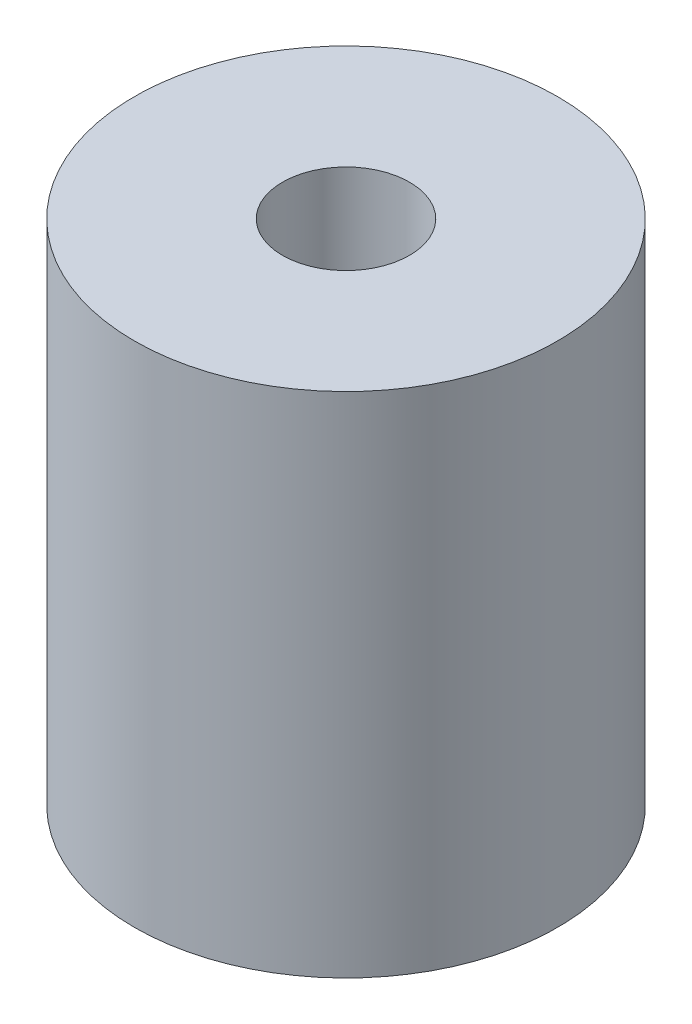
ISO-10303-21;
HEADER;
FILE_DESCRIPTION(('STEP AP214'),'2;1');
FILE_NAME('part.step','',(''),(''),'','','');
FILE_SCHEMA(('AUTOMOTIVE_DESIGN { 1 0 10303 214 1 1 1 1 }'));
ENDSEC;
DATA;
#1=APPLICATION_CONTEXT('core data for automotive mechanical design processes');
#2=APPLICATION_PROTOCOL_DEFINITION('international standard','automotive_design',2000,#1);
#3=PRODUCT_CONTEXT('',#1,'mechanical');
#4=PRODUCT('Part','Part','',(#3));
#5=PRODUCT_RELATED_PRODUCT_CATEGORY('part','',(#4));
#6=PRODUCT_DEFINITION_FORMATION('','',#4);
#7=PRODUCT_DEFINITION_CONTEXT('part definition',#1,'design');
#8=PRODUCT_DEFINITION('design','',#6,#7);
#9=PRODUCT_DEFINITION_SHAPE('','',#8);
#10=(LENGTH_UNIT() NAMED_UNIT(*) SI_UNIT(.MILLI.,.METRE.));
#11=(NAMED_UNIT(*) PLANE_ANGLE_UNIT() SI_UNIT($,.RADIAN.));
#12=(NAMED_UNIT(*) SI_UNIT($,.STERADIAN.) SOLID_ANGLE_UNIT());
#13=UNCERTAINTY_MEASURE_WITH_UNIT(LENGTH_MEASURE(1.E-05),#10,'distance_accuracy_value','');
#14=(GEOMETRIC_REPRESENTATION_CONTEXT(3) GLOBAL_UNCERTAINTY_ASSIGNED_CONTEXT((#13)) GLOBAL_UNIT_ASSIGNED_CONTEXT((#10,
#11,#12)) REPRESENTATION_CONTEXT('',''));
#15=CARTESIAN_POINT('',(0.,0.,0.));
#16=DIRECTION('',(0.,0.,1.));
#17=DIRECTION('',(1.,0.,0.));
#18=AXIS2_PLACEMENT_3D('',#15,#16,#17);
#19=CARTESIAN_POINT('',(0.,12.,0.));
#20=DIRECTION('',(0.,-1.,0.));
#21=DIRECTION('',(0.,0.,-1.));
#22=AXIS2_PLACEMENT_3D('',#19,#20,#21);
#23=CYLINDRICAL_SURFACE('',#22,5.);
#24=CARTESIAN_POINT('',(0.,12.,0.));
#25=DIRECTION('',(0.,1.,0.));
#26=DIRECTION('',(0.,0.,1.));
#27=AXIS2_PLACEMENT_3D('',#24,#25,#26);
#28=CIRCLE('',#27,5.);
#29=CARTESIAN_POINT('',(0.,12.,5.));
#30=VERTEX_POINT('',#29);
#31=EDGE_CURVE('E10',#30,#30,#28,.T.);
#32=ORIENTED_EDGE('',*,*,#31,.F.);
#33=EDGE_LOOP('',(#32));
#34=FACE_BOUND('',#33,.T.);
#35=CARTESIAN_POINT('',(0.,0.,0.));
#36=DIRECTION('',(0.,1.,0.));
#37=DIRECTION('',(0.,0.,1.));
#38=AXIS2_PLACEMENT_3D('',#35,#36,#37);
#39=CIRCLE('',#38,5.);
#40=CARTESIAN_POINT('',(0.,0.,5.));
#41=VERTEX_POINT('',#40);
#42=EDGE_CURVE('E34',#41,#41,#39,.T.);
#43=ORIENTED_EDGE('',*,*,#42,.T.);
#44=EDGE_LOOP('',(#43));
#45=FACE_BOUND('',#44,.T.);
#46=ADVANCED_FACE('F31',(#34,#45),#23,.T.);
#47=CARTESIAN_POINT('',(0.,12.,0.));
#48=DIRECTION('',(0.,1.,0.));
#49=DIRECTION('',(0.,0.,1.));
#50=AXIS2_PLACEMENT_3D('',#47,#48,#49);
#51=PLANE('',#50);
#52=CARTESIAN_POINT('',(0.,12.,0.));
#53=DIRECTION('',(0.,1.,0.));
#54=DIRECTION('',(0.,0.,1.));
#55=AXIS2_PLACEMENT_3D('',#52,#53,#54);
#56=CIRCLE('',#55,1.5);
#57=CARTESIAN_POINT('',(0.,12.,1.5));
#58=VERTEX_POINT('',#57);
#59=EDGE_CURVE('E43',#58,#58,#56,.T.);
#60=ORIENTED_EDGE('',*,*,#59,.F.);
#61=EDGE_LOOP('',(#60));
#62=FACE_BOUND('',#61,.T.);
#63=ORIENTED_EDGE('',*,*,#31,.T.);
#64=EDGE_LOOP('',(#63));
#65=FACE_BOUND('',#64,.T.);
#66=ADVANCED_FACE('F68',(#62,#65),#51,.T.);
#67=CARTESIAN_POINT('',(0.,0.,0.));
#68=DIRECTION('',(0.,1.,0.));
#69=DIRECTION('',(0.,0.,1.));
#70=AXIS2_PLACEMENT_3D('',#67,#68,#69);
#71=PLANE('',#70);
#72=CARTESIAN_POINT('',(0.,0.,0.));
#73=DIRECTION('',(0.,-1.,0.));
#74=DIRECTION('',(0.,0.,-1.));
#75=AXIS2_PLACEMENT_3D('',#72,#73,#74);
#76=CIRCLE('',#75,1.5);
#77=CARTESIAN_POINT('',(0.,0.,-1.5));
#78=VERTEX_POINT('',#77);
#79=EDGE_CURVE('E49',#78,#78,#76,.T.);
#80=ORIENTED_EDGE('',*,*,#79,.F.);
#81=EDGE_LOOP('',(#80));
#82=FACE_BOUND('',#81,.T.);
#83=ORIENTED_EDGE('',*,*,#42,.F.);
#84=EDGE_LOOP('',(#83));
#85=FACE_BOUND('',#84,.T.);
#86=ADVANCED_FACE('F64',(#82,#85),#71,.F.);
#87=CARTESIAN_POINT('',(0.,7.,0.));
#88=DIRECTION('',(0.,1.,0.));
#89=DIRECTION('',(0.,0.,1.));
#90=AXIS2_PLACEMENT_3D('',#87,#88,#89);
#91=CYLINDRICAL_SURFACE('',#90,1.5);
#92=CARTESIAN_POINT('',(0.,7.,0.));
#93=DIRECTION('',(0.,1.,0.));
#94=DIRECTION('',(0.,0.,1.));
#95=AXIS2_PLACEMENT_3D('',#92,#93,#94);
#96=CIRCLE('',#95,1.5);
#97=CARTESIAN_POINT('',(0.,7.,1.5));
#98=VERTEX_POINT('',#97);
#99=EDGE_CURVE('E41',#98,#98,#96,.T.);
#100=ORIENTED_EDGE('',*,*,#99,.F.);
#101=EDGE_LOOP('',(#100));
#102=FACE_BOUND('',#101,.T.);
#103=ORIENTED_EDGE('',*,*,#59,.T.);
#104=EDGE_LOOP('',(#103));
#105=FACE_BOUND('',#104,.T.);
#106=ADVANCED_FACE('F67',(#102,#105),#91,.F.);
#107=CARTESIAN_POINT('',(0.,7.,0.));
#108=DIRECTION('',(0.,1.,0.));
#109=DIRECTION('',(0.,0.,1.));
#110=AXIS2_PLACEMENT_3D('',#107,#108,#109);
#111=PLANE('',#110);
#112=ORIENTED_EDGE('',*,*,#99,.T.);
#113=EDGE_LOOP('',(#112));
#114=FACE_BOUND('',#113,.T.);
#115=ADVANCED_FACE('F60',(#114),#111,.T.);
#116=CARTESIAN_POINT('',(0.,5.,0.));
#117=DIRECTION('',(0.,-1.,0.));
#118=DIRECTION('',(0.,0.,-1.));
#119=AXIS2_PLACEMENT_3D('',#116,#117,#118);
#120=CYLINDRICAL_SURFACE('',#119,1.5);
#121=CARTESIAN_POINT('',(0.,5.,0.));
#122=DIRECTION('',(0.,-1.,0.));
#123=DIRECTION('',(0.,0.,-1.));
#124=AXIS2_PLACEMENT_3D('',#121,#122,#123);
#125=CIRCLE('',#124,1.5);
#126=CARTESIAN_POINT('',(0.,5.,-1.5));
#127=VERTEX_POINT('',#126);
#128=EDGE_CURVE('E46',#127,#127,#125,.T.);
#129=ORIENTED_EDGE('',*,*,#128,.F.);
#130=EDGE_LOOP('',(#129));
#131=FACE_BOUND('',#130,.T.);
#132=ORIENTED_EDGE('',*,*,#79,.T.);
#133=EDGE_LOOP('',(#132));
#134=FACE_BOUND('',#133,.T.);
#135=ADVANCED_FACE('F57',(#131,#134),#120,.F.);
#136=CARTESIAN_POINT('',(0.,5.,0.));
#137=DIRECTION('',(0.,-1.,0.));
#138=DIRECTION('',(0.,0.,-1.));
#139=AXIS2_PLACEMENT_3D('',#136,#137,#138);
#140=PLANE('',#139);
#141=ORIENTED_EDGE('',*,*,#128,.T.);
#142=EDGE_LOOP('',(#141));
#143=FACE_BOUND('',#142,.T.);
#144=ADVANCED_FACE('F55',(#143),#140,.T.);
#145=CLOSED_SHELL('',(#46,#66,#86,#106,#115,#135,#144));
#146=MANIFOLD_SOLID_BREP('B2',#145);
#147=ADVANCED_BREP_SHAPE_REPRESENTATION('',(#18,#146),#14);
#148=SHAPE_DEFINITION_REPRESENTATION(#9,#147);
ENDSEC;
END-ISO-10303-21;
